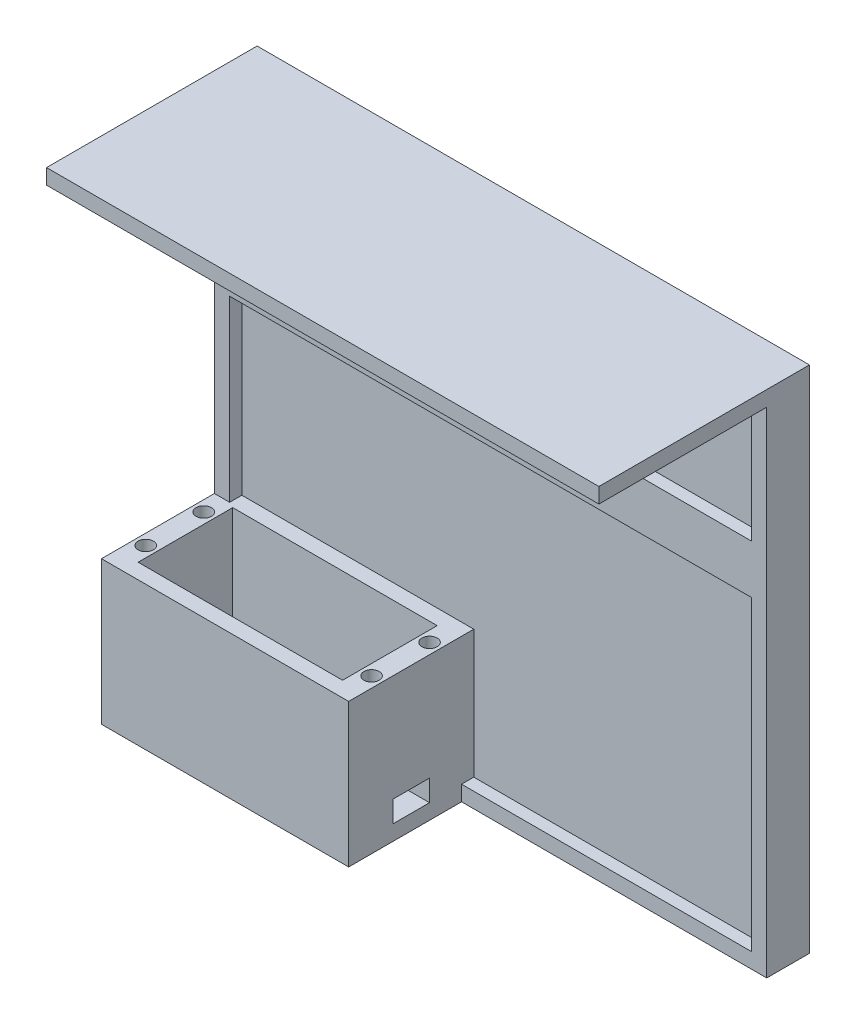
ISO-10303-21;
HEADER;
FILE_DESCRIPTION(('STEP AP214'),'2;1');
FILE_NAME('part.step','',(''),(''),'','','');
FILE_SCHEMA(('AUTOMOTIVE_DESIGN { 1 0 10303 214 1 1 1 1 }'));
ENDSEC;
DATA;
#1=APPLICATION_CONTEXT('core data for automotive mechanical design processes');
#2=APPLICATION_PROTOCOL_DEFINITION('international standard','automotive_design',2000,#1);
#3=PRODUCT_CONTEXT('',#1,'mechanical');
#4=PRODUCT('Part','Part','',(#3));
#5=PRODUCT_RELATED_PRODUCT_CATEGORY('part','',(#4));
#6=PRODUCT_DEFINITION_FORMATION('','',#4);
#7=PRODUCT_DEFINITION_CONTEXT('part definition',#1,'design');
#8=PRODUCT_DEFINITION('design','',#6,#7);
#9=PRODUCT_DEFINITION_SHAPE('','',#8);
#10=(LENGTH_UNIT() NAMED_UNIT(*) SI_UNIT(.MILLI.,.METRE.));
#11=(NAMED_UNIT(*) PLANE_ANGLE_UNIT() SI_UNIT($,.RADIAN.));
#12=(NAMED_UNIT(*) SI_UNIT($,.STERADIAN.) SOLID_ANGLE_UNIT());
#13=UNCERTAINTY_MEASURE_WITH_UNIT(LENGTH_MEASURE(1.E-05),#10,'distance_accuracy_value','');
#14=(GEOMETRIC_REPRESENTATION_CONTEXT(3) GLOBAL_UNCERTAINTY_ASSIGNED_CONTEXT((#13)) GLOBAL_UNIT_ASSIGNED_CONTEXT((#10,
#11,#12)) REPRESENTATION_CONTEXT('',''));
#15=CARTESIAN_POINT('',(0.,0.,0.));
#16=DIRECTION('',(0.,0.,1.));
#17=DIRECTION('',(1.,0.,0.));
#18=AXIS2_PLACEMENT_3D('',#15,#16,#17);
#19=CARTESIAN_POINT('',(0.,0.,-16.5));
#20=DIRECTION('',(0.,0.,-1.));
#21=DIRECTION('',(-1.,0.,0.));
#22=AXIS2_PLACEMENT_3D('',#19,#20,#21);
#23=PLANE('',#22);
#24=DIRECTION('',(1.,0.,0.));
#25=VECTOR('',#24,1.);
#26=CARTESIAN_POINT('',(-40.5,157.,-16.5));
#27=LINE('',#26,#25);
#28=CARTESIAN_POINT('',(-40.5,157.,-16.5));
#29=VERTEX_POINT('',#28);
#30=CARTESIAN_POINT('',(-35.5,157.,-16.5));
#31=VERTEX_POINT('',#30);
#32=EDGE_CURVE('E115',#29,#31,#27,.T.);
#33=ORIENTED_EDGE('',*,*,#32,.F.);
#34=DIRECTION('',(0.,-1.,0.));
#35=VECTOR('',#34,1.);
#36=CARTESIAN_POINT('',(-40.5,100.5,-16.5));
#37=LINE('',#36,#35);
#38=CARTESIAN_POINT('',(-40.5,42.,-16.5));
#39=VERTEX_POINT('',#38);
#40=EDGE_CURVE('E317',#29,#39,#37,.T.);
#41=ORIENTED_EDGE('',*,*,#40,.T.);
#42=DIRECTION('',(1.,0.,0.));
#43=VECTOR('',#42,1.);
#44=CARTESIAN_POINT('',(-40.5,42.,-16.5));
#45=LINE('',#44,#43);
#46=CARTESIAN_POINT('',(-35.5,42.,-16.5));
#47=VERTEX_POINT('',#46);
#48=EDGE_CURVE('E348',#39,#47,#45,.T.);
#49=ORIENTED_EDGE('',*,*,#48,.T.);
#50=DIRECTION('',(0.,1.,0.));
#51=VECTOR('',#50,1.);
#52=CARTESIAN_POINT('',(-35.5,42.,-16.5));
#53=LINE('',#52,#51);
#54=CARTESIAN_POINT('',(-35.5,100.5,-16.5));
#55=VERTEX_POINT('',#54);
#56=EDGE_CURVE('E353',#47,#55,#53,.T.);
#57=ORIENTED_EDGE('',*,*,#56,.T.);
#58=DIRECTION('',(1.,0.,0.));
#59=VECTOR('',#58,1.);
#60=CARTESIAN_POINT('',(-40.5,100.5,-16.5));
#61=LINE('',#60,#59);
#62=CARTESIAN_POINT('',(135.5,100.5,-16.5));
#63=VERTEX_POINT('',#62);
#64=EDGE_CURVE('E382',#55,#63,#61,.T.);
#65=ORIENTED_EDGE('',*,*,#64,.T.);
#66=DIRECTION('',(0.,1.,0.));
#67=VECTOR('',#66,1.);
#68=CARTESIAN_POINT('',(135.5,0.,-16.5));
#69=LINE('',#68,#67);
#70=CARTESIAN_POINT('',(135.5,0.,-16.5));
#71=VERTEX_POINT('',#70);
#72=EDGE_CURVE('E359',#71,#63,#69,.T.);
#73=ORIENTED_EDGE('',*,*,#72,.F.);
#74=DIRECTION('',(1.,0.,0.));
#75=VECTOR('',#74,1.);
#76=CARTESIAN_POINT('',(0.,0.,-16.5));
#77=LINE('',#76,#75);
#78=CARTESIAN_POINT('',(40.5,0.,-16.5));
#79=VERTEX_POINT('',#78);
#80=EDGE_CURVE('E363',#79,#71,#77,.T.);
#81=ORIENTED_EDGE('',*,*,#80,.F.);
#82=DIRECTION('',(0.,-1.,0.));
#83=VECTOR('',#82,1.);
#84=CARTESIAN_POINT('',(40.5,0.,-16.5));
#85=LINE('',#84,#83);
#86=CARTESIAN_POINT('',(40.5,-5.,-16.5));
#87=VERTEX_POINT('',#86);
#88=EDGE_CURVE('E366',#79,#87,#85,.T.);
#89=ORIENTED_EDGE('',*,*,#88,.T.);
#90=DIRECTION('',(1.,0.,0.));
#91=VECTOR('',#90,1.);
#92=CARTESIAN_POINT('',(0.,-5.,-16.5));
#93=LINE('',#92,#91);
#94=CARTESIAN_POINT('',(140.5,-5.,-16.5));
#95=VERTEX_POINT('',#94);
#96=EDGE_CURVE('E357',#87,#95,#93,.T.);
#97=ORIENTED_EDGE('',*,*,#96,.T.);
#98=DIRECTION('',(0.,1.,0.));
#99=VECTOR('',#98,1.);
#100=CARTESIAN_POINT('',(140.5,100.5,-16.5));
#101=LINE('',#100,#99);
#102=CARTESIAN_POINT('',(140.5,157.,-16.5));
#103=VERTEX_POINT('',#102);
#104=EDGE_CURVE('E108',#95,#103,#101,.T.);
#105=ORIENTED_EDGE('',*,*,#104,.T.);
#106=CARTESIAN_POINT('',(135.5,157.,-16.5));
#107=VERTEX_POINT('',#106);
#108=EDGE_CURVE('E1071',#107,#103,#27,.T.);
#109=ORIENTED_EDGE('',*,*,#108,.F.);
#110=DIRECTION('',(0.,-1.,0.));
#111=VECTOR('',#110,1.);
#112=CARTESIAN_POINT('',(135.5,162.,-16.5));
#113=LINE('',#112,#111);
#114=CARTESIAN_POINT('',(135.5,116.5,-16.5));
#115=VERTEX_POINT('',#114);
#116=EDGE_CURVE('E333',#107,#115,#113,.T.);
#117=ORIENTED_EDGE('',*,*,#116,.T.);
#118=DIRECTION('',(-1.,0.,0.));
#119=VECTOR('',#118,1.);
#120=CARTESIAN_POINT('',(-40.5,116.5,-16.5));
#121=LINE('',#120,#119);
#122=CARTESIAN_POINT('',(-35.5,116.5,-16.5));
#123=VERTEX_POINT('',#122);
#124=EDGE_CURVE('E386',#115,#123,#121,.T.);
#125=ORIENTED_EDGE('',*,*,#124,.T.);
#126=DIRECTION('',(0.,1.,0.));
#127=VECTOR('',#126,1.);
#128=CARTESIAN_POINT('',(-35.5,116.5,-16.5));
#129=LINE('',#128,#127);
#130=EDGE_CURVE('E341',#123,#31,#129,.T.);
#131=ORIENTED_EDGE('',*,*,#130,.T.);
#132=EDGE_LOOP('',(#33,#41,#49,#57,#65,#73,#81,#89,#97,#105,#109,#117,#125,#131));
#133=FACE_BOUND('',#132,.T.);
#134=ADVANCED_FACE('F91',(#133),#23,.F.);
#135=CARTESIAN_POINT('',(40.5,162.,-20.5));
#136=DIRECTION('',(0.,0.,-1.));
#137=DIRECTION('',(-1.,0.,0.));
#138=AXIS2_PLACEMENT_3D('',#135,#136,#137);
#139=PLANE('',#138);
#140=DIRECTION('',(0.,1.,0.));
#141=VECTOR('',#140,1.);
#142=CARTESIAN_POINT('',(-35.5,116.5,-20.5));
#143=LINE('',#142,#141);
#144=CARTESIAN_POINT('',(-35.5,116.5,-20.5));
#145=VERTEX_POINT('',#144);
#146=CARTESIAN_POINT('',(-35.5,157.,-20.5));
#147=VERTEX_POINT('',#146);
#148=EDGE_CURVE('E329',#145,#147,#143,.T.);
#149=ORIENTED_EDGE('',*,*,#148,.F.);
#150=DIRECTION('',(-1.,0.,0.));
#151=VECTOR('',#150,1.);
#152=CARTESIAN_POINT('',(-40.5,116.5,-20.5));
#153=LINE('',#152,#151);
#154=CARTESIAN_POINT('',(135.5,116.5,-20.5));
#155=VERTEX_POINT('',#154);
#156=EDGE_CURVE('E383',#155,#145,#153,.T.);
#157=ORIENTED_EDGE('',*,*,#156,.F.);
#158=DIRECTION('',(0.,-1.,0.));
#159=VECTOR('',#158,1.);
#160=CARTESIAN_POINT('',(135.5,162.,-20.5));
#161=LINE('',#160,#159);
#162=CARTESIAN_POINT('',(135.5,157.,-20.5));
#163=VERTEX_POINT('',#162);
#164=EDGE_CURVE('E334',#163,#155,#161,.T.);
#165=ORIENTED_EDGE('',*,*,#164,.F.);
#166=DIRECTION('',(1.,0.,0.));
#167=VECTOR('',#166,1.);
#168=CARTESIAN_POINT('',(-40.5,157.,-20.5));
#169=LINE('',#168,#167);
#170=EDGE_CURVE('E328',#147,#163,#169,.T.);
#171=ORIENTED_EDGE('',*,*,#170,.F.);
#172=EDGE_LOOP('',(#149,#157,#165,#171));
#173=FACE_BOUND('',#172,.T.);
#174=ADVANCED_FACE('F589',(#173),#139,.F.);
#175=CARTESIAN_POINT('',(-40.5,116.5,-16.5));
#176=DIRECTION('',(0.,-1.,0.));
#177=DIRECTION('',(0.,0.,-1.));
#178=AXIS2_PLACEMENT_3D('',#175,#176,#177);
#179=PLANE('',#178);
#180=DIRECTION('',(0.,0.,-1.));
#181=VECTOR('',#180,1.);
#182=CARTESIAN_POINT('',(-35.5,116.5,-16.5));
#183=LINE('',#182,#181);
#184=EDGE_CURVE('E320',#123,#145,#183,.T.);
#185=ORIENTED_EDGE('',*,*,#184,.F.);
#186=ORIENTED_EDGE('',*,*,#124,.F.);
#187=DIRECTION('',(0.,0.,-1.));
#188=VECTOR('',#187,1.);
#189=CARTESIAN_POINT('',(135.5,116.5,-16.5));
#190=LINE('',#189,#188);
#191=EDGE_CURVE('E330',#115,#155,#190,.T.);
#192=ORIENTED_EDGE('',*,*,#191,.T.);
#193=ORIENTED_EDGE('',*,*,#156,.T.);
#194=EDGE_LOOP('',(#185,#186,#192,#193));
#195=FACE_BOUND('',#194,.T.);
#196=ADVANCED_FACE('F594',(#195),#179,.F.);
#197=DIRECTION('',(0.,1.,0.));
#198=VECTOR('',#197,1.);
#199=CARTESIAN_POINT('',(-35.5,42.,-20.5));
#200=LINE('',#199,#198);
#201=CARTESIAN_POINT('',(-35.5,42.,-20.5));
#202=VERTEX_POINT('',#201);
#203=CARTESIAN_POINT('',(-35.5,100.5,-20.5));
#204=VERTEX_POINT('',#203);
#205=EDGE_CURVE('E350',#202,#204,#200,.T.);
#206=ORIENTED_EDGE('',*,*,#205,.F.);
#207=DIRECTION('',(1.,0.,0.));
#208=VECTOR('',#207,1.);
#209=CARTESIAN_POINT('',(40.5,42.,-20.5));
#210=LINE('',#209,#208);
#211=CARTESIAN_POINT('',(40.5,42.,-20.5));
#212=VERTEX_POINT('',#211);
#213=EDGE_CURVE('E399',#202,#212,#210,.T.);
#214=ORIENTED_EDGE('',*,*,#213,.T.);
#215=DIRECTION('',(0.,-1.,0.));
#216=VECTOR('',#215,1.);
#217=CARTESIAN_POINT('',(40.5,-5.,-20.5));
#218=LINE('',#217,#216);
#219=CARTESIAN_POINT('',(40.5,0.,-20.5));
#220=VERTEX_POINT('',#219);
#221=EDGE_CURVE('E12',#212,#220,#218,.T.);
#222=ORIENTED_EDGE('',*,*,#221,.T.);
#223=DIRECTION('',(1.,0.,0.));
#224=VECTOR('',#223,1.);
#225=CARTESIAN_POINT('',(0.,0.,-20.5));
#226=LINE('',#225,#224);
#227=CARTESIAN_POINT('',(135.5,0.,-20.5));
#228=VERTEX_POINT('',#227);
#229=EDGE_CURVE('E360',#220,#228,#226,.T.);
#230=ORIENTED_EDGE('',*,*,#229,.T.);
#231=DIRECTION('',(0.,1.,0.));
#232=VECTOR('',#231,1.);
#233=CARTESIAN_POINT('',(135.5,0.,-20.5));
#234=LINE('',#233,#232);
#235=CARTESIAN_POINT('',(135.5,100.5,-20.5));
#236=VERTEX_POINT('',#235);
#237=EDGE_CURVE('E352',#228,#236,#234,.T.);
#238=ORIENTED_EDGE('',*,*,#237,.T.);
#239=DIRECTION('',(1.,0.,0.));
#240=VECTOR('',#239,1.);
#241=CARTESIAN_POINT('',(-40.5,100.5,-20.5));
#242=LINE('',#241,#240);
#243=EDGE_CURVE('E380',#204,#236,#242,.T.);
#244=ORIENTED_EDGE('',*,*,#243,.F.);
#245=EDGE_LOOP('',(#206,#214,#222,#230,#238,#244));
#246=FACE_BOUND('',#245,.T.);
#247=ADVANCED_FACE('F562',(#246),#139,.F.);
#248=CARTESIAN_POINT('',(0.,42.,0.));
#249=DIRECTION('',(0.,-1.,0.));
#250=DIRECTION('',(0.,0.,-1.));
#251=AXIS2_PLACEMENT_3D('',#248,#249,#250);
#252=PLANE('',#251);
#253=CARTESIAN_POINT('',(37.,42.,-9.5));
#254=DIRECTION('',(0.,-1.,0.));
#255=DIRECTION('',(0.,0.,1.));
#256=AXIS2_PLACEMENT_3D('',#253,#254,#255);
#257=CIRCLE('',#256,2.5);
#258=CARTESIAN_POINT('',(37.,42.,-7.));
#259=VERTEX_POINT('',#258);
#260=EDGE_CURVE('E445',#259,#259,#257,.T.);
#261=ORIENTED_EDGE('',*,*,#260,.T.);
#262=EDGE_LOOP('',(#261));
#263=FACE_BOUND('',#262,.T.);
#264=CARTESIAN_POINT('',(37.,42.,9.5));
#265=DIRECTION('',(0.,-1.,0.));
#266=DIRECTION('',(0.,0.,1.));
#267=AXIS2_PLACEMENT_3D('',#264,#265,#266);
#268=CIRCLE('',#267,2.5);
#269=CARTESIAN_POINT('',(37.,42.,12.));
#270=VERTEX_POINT('',#269);
#271=EDGE_CURVE('E440',#270,#270,#268,.T.);
#272=ORIENTED_EDGE('',*,*,#271,.T.);
#273=EDGE_LOOP('',(#272));
#274=FACE_BOUND('',#273,.T.);
#275=CARTESIAN_POINT('',(-37.,42.,-9.5));
#276=DIRECTION('',(0.,1.,0.));
#277=DIRECTION('',(0.,0.,1.));
#278=AXIS2_PLACEMENT_3D('',#275,#276,#277);
#279=CIRCLE('',#278,2.5);
#280=CARTESIAN_POINT('',(-37.,42.,-7.));
#281=VERTEX_POINT('',#280);
#282=EDGE_CURVE('E486',#281,#281,#279,.T.);
#283=ORIENTED_EDGE('',*,*,#282,.F.);
#284=EDGE_LOOP('',(#283));
#285=FACE_BOUND('',#284,.T.);
#286=CARTESIAN_POINT('',(-37.,42.,9.5));
#287=DIRECTION('',(0.,1.,0.));
#288=DIRECTION('',(0.,0.,1.));
#289=AXIS2_PLACEMENT_3D('',#286,#287,#288);
#290=CIRCLE('',#289,2.5);
#291=CARTESIAN_POINT('',(-37.,42.,12.));
#292=VERTEX_POINT('',#291);
#293=EDGE_CURVE('E489',#292,#292,#290,.T.);
#294=ORIENTED_EDGE('',*,*,#293,.F.);
#295=EDGE_LOOP('',(#294));
#296=FACE_BOUND('',#295,.T.);
#297=DIRECTION('',(0.,0.,-1.));
#298=VECTOR('',#297,1.);
#299=CARTESIAN_POINT('',(33.5,42.,15.5));
#300=LINE('',#299,#298);
#301=CARTESIAN_POINT('',(33.5,42.,15.5));
#302=VERTEX_POINT('',#301);
#303=CARTESIAN_POINT('',(33.5,42.,-15.5));
#304=VERTEX_POINT('',#303);
#305=EDGE_CURVE('E497',#302,#304,#300,.T.);
#306=ORIENTED_EDGE('',*,*,#305,.F.);
#307=DIRECTION('',(1.,0.,0.));
#308=VECTOR('',#307,1.);
#309=CARTESIAN_POINT('',(-33.5,42.,15.5));
#310=LINE('',#309,#308);
#311=CARTESIAN_POINT('',(-33.5,42.,15.5));
#312=VERTEX_POINT('',#311);
#313=EDGE_CURVE('E516',#312,#302,#310,.T.);
#314=ORIENTED_EDGE('',*,*,#313,.F.);
#315=DIRECTION('',(0.,0.,1.));
#316=VECTOR('',#315,1.);
#317=CARTESIAN_POINT('',(-33.5,42.,15.5));
#318=LINE('',#317,#316);
#319=CARTESIAN_POINT('',(-33.5,42.,-15.5));
#320=VERTEX_POINT('',#319);
#321=EDGE_CURVE('E513',#320,#312,#318,.T.);
#322=ORIENTED_EDGE('',*,*,#321,.F.);
#323=DIRECTION('',(-1.,0.,0.));
#324=VECTOR('',#323,1.);
#325=CARTESIAN_POINT('',(-33.5,42.,-15.5));
#326=LINE('',#325,#324);
#327=EDGE_CURVE('E510',#304,#320,#326,.T.);
#328=ORIENTED_EDGE('',*,*,#327,.F.);
#329=EDGE_LOOP('',(#306,#314,#322,#328));
#330=FACE_BOUND('',#329,.T.);
#331=DIRECTION('',(0.,0.,-1.));
#332=VECTOR('',#331,1.);
#333=CARTESIAN_POINT('',(-35.5,42.,-16.5));
#334=LINE('',#333,#332);
#335=EDGE_CURVE('E336',#47,#202,#334,.T.);
#336=ORIENTED_EDGE('',*,*,#335,.F.);
#337=ORIENTED_EDGE('',*,*,#48,.F.);
#338=DIRECTION('',(0.,0.,1.));
#339=VECTOR('',#338,1.);
#340=CARTESIAN_POINT('',(-40.5,42.,20.5));
#341=LINE('',#340,#339);
#342=CARTESIAN_POINT('',(-40.5,42.,20.5));
#343=VERTEX_POINT('',#342);
#344=EDGE_CURVE('E522',#39,#343,#341,.T.);
#345=ORIENTED_EDGE('',*,*,#344,.T.);
#346=DIRECTION('',(1.,0.,0.));
#347=VECTOR('',#346,1.);
#348=CARTESIAN_POINT('',(-40.5,42.,20.5));
#349=LINE('',#348,#347);
#350=CARTESIAN_POINT('',(40.5,42.,20.5));
#351=VERTEX_POINT('',#350);
#352=EDGE_CURVE('E524',#343,#351,#349,.T.);
#353=ORIENTED_EDGE('',*,*,#352,.T.);
#354=DIRECTION('',(0.,0.,-1.));
#355=VECTOR('',#354,1.);
#356=CARTESIAN_POINT('',(40.5,42.,20.5));
#357=LINE('',#356,#355);
#358=EDGE_CURVE('E519',#351,#212,#357,.T.);
#359=ORIENTED_EDGE('',*,*,#358,.T.);
#360=ORIENTED_EDGE('',*,*,#213,.F.);
#361=EDGE_LOOP('',(#336,#337,#345,#353,#359,#360));
#362=FACE_BOUND('',#361,.T.);
#363=ADVANCED_FACE('F552',(#263,#274,#285,#296,#330,#362),#252,.F.);
#364=CARTESIAN_POINT('',(-40.5,100.5,-16.5));
#365=DIRECTION('',(0.,1.,0.));
#366=DIRECTION('',(0.,0.,1.));
#367=AXIS2_PLACEMENT_3D('',#364,#365,#366);
#368=PLANE('',#367);
#369=DIRECTION('',(0.,0.,-1.));
#370=VECTOR('',#369,1.);
#371=CARTESIAN_POINT('',(-35.5,100.5,-16.5));
#372=LINE('',#371,#370);
#373=EDGE_CURVE('E345',#55,#204,#372,.T.);
#374=ORIENTED_EDGE('',*,*,#373,.T.);
#375=ORIENTED_EDGE('',*,*,#243,.T.);
#376=DIRECTION('',(0.,0.,-1.));
#377=VECTOR('',#376,1.);
#378=CARTESIAN_POINT('',(135.5,100.5,-16.5));
#379=LINE('',#378,#377);
#380=EDGE_CURVE('E377',#63,#236,#379,.T.);
#381=ORIENTED_EDGE('',*,*,#380,.F.);
#382=ORIENTED_EDGE('',*,*,#64,.F.);
#383=EDGE_LOOP('',(#374,#375,#381,#382));
#384=FACE_BOUND('',#383,.T.);
#385=ADVANCED_FACE('F571',(#384),#368,.F.);
#386=CARTESIAN_POINT('',(33.5,-5.,15.5));
#387=DIRECTION('',(1.,0.,0.));
#388=DIRECTION('',(0.,0.,-1.));
#389=AXIS2_PLACEMENT_3D('',#386,#387,#388);
#390=PLANE('',#389);
#391=DIRECTION('',(0.,-1.,0.));
#392=VECTOR('',#391,1.);
#393=CARTESIAN_POINT('',(33.5,-5.,-6.));
#394=LINE('',#393,#392);
#395=CARTESIAN_POINT('',(33.5,7.,-6.));
#396=VERTEX_POINT('',#395);
#397=CARTESIAN_POINT('',(33.5,0.,-6.));
#398=VERTEX_POINT('',#397);
#399=EDGE_CURVE('E436',#396,#398,#394,.T.);
#400=ORIENTED_EDGE('',*,*,#399,.F.);
#401=DIRECTION('',(0.,0.,-1.));
#402=VECTOR('',#401,1.);
#403=CARTESIAN_POINT('',(33.5,7.,15.5));
#404=LINE('',#403,#402);
#405=CARTESIAN_POINT('',(33.5,7.,6.));
#406=VERTEX_POINT('',#405);
#407=EDGE_CURVE('E438',#406,#396,#404,.T.);
#408=ORIENTED_EDGE('',*,*,#407,.F.);
#409=DIRECTION('',(0.,1.,0.));
#410=VECTOR('',#409,1.);
#411=CARTESIAN_POINT('',(33.5,-5.,6.));
#412=LINE('',#411,#410);
#413=CARTESIAN_POINT('',(33.5,0.,6.));
#414=VERTEX_POINT('',#413);
#415=EDGE_CURVE('E427',#414,#406,#412,.T.);
#416=ORIENTED_EDGE('',*,*,#415,.F.);
#417=DIRECTION('',(0.,0.,1.));
#418=VECTOR('',#417,1.);
#419=CARTESIAN_POINT('',(33.5,0.,15.5));
#420=LINE('',#419,#418);
#421=CARTESIAN_POINT('',(33.5,0.,15.5));
#422=VERTEX_POINT('',#421);
#423=EDGE_CURVE('E485',#414,#422,#420,.T.);
#424=ORIENTED_EDGE('',*,*,#423,.T.);
#425=DIRECTION('',(0.,1.,0.));
#426=VECTOR('',#425,1.);
#427=CARTESIAN_POINT('',(33.5,-5.,15.5));
#428=LINE('',#427,#426);
#429=EDGE_CURVE('E528',#422,#302,#428,.T.);
#430=ORIENTED_EDGE('',*,*,#429,.T.);
#431=ORIENTED_EDGE('',*,*,#305,.T.);
#432=DIRECTION('',(0.,1.,0.));
#433=VECTOR('',#432,1.);
#434=CARTESIAN_POINT('',(33.5,-5.,-15.5));
#435=LINE('',#434,#433);
#436=CARTESIAN_POINT('',(33.5,0.,-15.5));
#437=VERTEX_POINT('',#436);
#438=EDGE_CURVE('E527',#437,#304,#435,.T.);
#439=ORIENTED_EDGE('',*,*,#438,.F.);
#440=EDGE_CURVE('E503',#437,#398,#420,.T.);
#441=ORIENTED_EDGE('',*,*,#440,.T.);
#442=EDGE_LOOP('',(#400,#408,#416,#424,#430,#431,#439,#441));
#443=FACE_BOUND('',#442,.T.);
#444=ADVANCED_FACE('F603',(#443),#390,.F.);
#445=CARTESIAN_POINT('',(40.5,-5.,20.5));
#446=DIRECTION('',(1.,0.,0.));
#447=DIRECTION('',(0.,0.,-1.));
#448=AXIS2_PLACEMENT_3D('',#445,#446,#447);
#449=PLANE('',#448);
#450=DIRECTION('',(0.,0.,-1.));
#451=VECTOR('',#450,1.);
#452=CARTESIAN_POINT('',(40.5,0.,-16.5));
#453=LINE('',#452,#451);
#454=EDGE_CURVE('E368',#79,#220,#453,.T.);
#455=ORIENTED_EDGE('',*,*,#454,.T.);
#456=ORIENTED_EDGE('',*,*,#221,.F.);
#457=ORIENTED_EDGE('',*,*,#358,.F.);
#458=DIRECTION('',(0.,1.,0.));
#459=VECTOR('',#458,1.);
#460=CARTESIAN_POINT('',(40.5,-5.,20.5));
#461=LINE('',#460,#459);
#462=CARTESIAN_POINT('',(40.5,-5.,20.5));
#463=VERTEX_POINT('',#462);
#464=EDGE_CURVE('E100',#463,#351,#461,.T.);
#465=ORIENTED_EDGE('',*,*,#464,.F.);
#466=DIRECTION('',(0.,0.,-1.));
#467=VECTOR('',#466,1.);
#468=CARTESIAN_POINT('',(40.5,-5.,20.5));
#469=LINE('',#468,#467);
#470=EDGE_CURVE('E530',#463,#87,#469,.T.);
#471=ORIENTED_EDGE('',*,*,#470,.T.);
#472=ORIENTED_EDGE('',*,*,#88,.F.);
#473=EDGE_LOOP('',(#455,#456,#457,#465,#471,#472));
#474=FACE_BOUND('',#473,.T.);
#475=DIRECTION('',(0.,0.,-1.));
#476=VECTOR('',#475,1.);
#477=CARTESIAN_POINT('',(40.5,7.,-6.));
#478=LINE('',#477,#476);
#479=CARTESIAN_POINT('',(40.5,7.,6.));
#480=VERTEX_POINT('',#479);
#481=CARTESIAN_POINT('',(40.5,7.,-6.));
#482=VERTEX_POINT('',#481);
#483=EDGE_CURVE('E415',#480,#482,#478,.T.);
#484=ORIENTED_EDGE('',*,*,#483,.T.);
#485=DIRECTION('',(0.,-1.,0.));
#486=VECTOR('',#485,1.);
#487=CARTESIAN_POINT('',(40.5,0.,-6.));
#488=LINE('',#487,#486);
#489=CARTESIAN_POINT('',(40.5,0.,-6.));
#490=VERTEX_POINT('',#489);
#491=EDGE_CURVE('E412',#482,#490,#488,.T.);
#492=ORIENTED_EDGE('',*,*,#491,.T.);
#493=DIRECTION('',(0.,0.,1.));
#494=VECTOR('',#493,1.);
#495=CARTESIAN_POINT('',(40.5,0.,-6.));
#496=LINE('',#495,#494);
#497=CARTESIAN_POINT('',(40.5,0.,6.));
#498=VERTEX_POINT('',#497);
#499=EDGE_CURVE('E421',#490,#498,#496,.T.);
#500=ORIENTED_EDGE('',*,*,#499,.T.);
#501=DIRECTION('',(0.,1.,0.));
#502=VECTOR('',#501,1.);
#503=CARTESIAN_POINT('',(40.5,0.,6.));
#504=LINE('',#503,#502);
#505=EDGE_CURVE('E418',#498,#480,#504,.T.);
#506=ORIENTED_EDGE('',*,*,#505,.T.);
#507=EDGE_LOOP('',(#484,#492,#500,#506));
#508=FACE_BOUND('',#507,.T.);
#509=ADVANCED_FACE('F93',(#474,#508),#449,.T.);
#510=CARTESIAN_POINT('',(-33.5,-5.,15.5));
#511=DIRECTION('',(0.,0.,1.));
#512=DIRECTION('',(1.,0.,0.));
#513=AXIS2_PLACEMENT_3D('',#510,#511,#512);
#514=PLANE('',#513);
#515=DIRECTION('',(-1.,0.,0.));
#516=VECTOR('',#515,1.);
#517=CARTESIAN_POINT('',(40.502,0.,15.5));
#518=LINE('',#517,#516);
#519=CARTESIAN_POINT('',(-33.5,0.,15.5));
#520=VERTEX_POINT('',#519);
#521=EDGE_CURVE('E502',#422,#520,#518,.T.);
#522=ORIENTED_EDGE('',*,*,#521,.T.);
#523=DIRECTION('',(0.,1.,0.));
#524=VECTOR('',#523,1.);
#525=CARTESIAN_POINT('',(-33.5,-5.,15.5));
#526=LINE('',#525,#524);
#527=EDGE_CURVE('E531',#520,#312,#526,.T.);
#528=ORIENTED_EDGE('',*,*,#527,.T.);
#529=ORIENTED_EDGE('',*,*,#313,.T.);
#530=ORIENTED_EDGE('',*,*,#429,.F.);
#531=EDGE_LOOP('',(#522,#528,#529,#530));
#532=FACE_BOUND('',#531,.T.);
#533=ADVANCED_FACE('F664',(#532),#514,.F.);
#534=CARTESIAN_POINT('',(-33.5,-5.,15.5));
#535=DIRECTION('',(-1.,0.,0.));
#536=DIRECTION('',(0.,0.,1.));
#537=AXIS2_PLACEMENT_3D('',#534,#535,#536);
#538=PLANE('',#537);
#539=DIRECTION('',(0.,0.,-1.));
#540=VECTOR('',#539,1.);
#541=CARTESIAN_POINT('',(-33.5,7.,15.5));
#542=LINE('',#541,#540);
#543=CARTESIAN_POINT('',(-33.5,7.,6.));
#544=VERTEX_POINT('',#543);
#545=CARTESIAN_POINT('',(-33.5,7.,-6.));
#546=VERTEX_POINT('',#545);
#547=EDGE_CURVE('E478',#544,#546,#542,.T.);
#548=ORIENTED_EDGE('',*,*,#547,.T.);
#549=DIRECTION('',(0.,-1.,0.));
#550=VECTOR('',#549,1.);
#551=CARTESIAN_POINT('',(-33.5,-5.,-6.));
#552=LINE('',#551,#550);
#553=CARTESIAN_POINT('',(-33.5,0.,-6.));
#554=VERTEX_POINT('',#553);
#555=EDGE_CURVE('E475',#546,#554,#552,.T.);
#556=ORIENTED_EDGE('',*,*,#555,.T.);
#557=DIRECTION('',(0.,0.,1.));
#558=VECTOR('',#557,1.);
#559=CARTESIAN_POINT('',(-33.5,0.,15.5));
#560=LINE('',#559,#558);
#561=CARTESIAN_POINT('',(-33.5,0.,-15.5));
#562=VERTEX_POINT('',#561);
#563=EDGE_CURVE('E494',#562,#554,#560,.T.);
#564=ORIENTED_EDGE('',*,*,#563,.F.);
#565=DIRECTION('',(0.,1.,0.));
#566=VECTOR('',#565,1.);
#567=CARTESIAN_POINT('',(-33.5,-5.,-15.5));
#568=LINE('',#567,#566);
#569=EDGE_CURVE('E533',#562,#320,#568,.T.);
#570=ORIENTED_EDGE('',*,*,#569,.T.);
#571=ORIENTED_EDGE('',*,*,#321,.T.);
#572=ORIENTED_EDGE('',*,*,#527,.F.);
#573=CARTESIAN_POINT('',(-33.5,0.,6.));
#574=VERTEX_POINT('',#573);
#575=EDGE_CURVE('E498',#574,#520,#560,.T.);
#576=ORIENTED_EDGE('',*,*,#575,.F.);
#577=DIRECTION('',(0.,1.,0.));
#578=VECTOR('',#577,1.);
#579=CARTESIAN_POINT('',(-33.5,-5.,6.));
#580=LINE('',#579,#578);
#581=EDGE_CURVE('E466',#574,#544,#580,.T.);
#582=ORIENTED_EDGE('',*,*,#581,.T.);
#583=EDGE_LOOP('',(#548,#556,#564,#570,#571,#572,#576,#582));
#584=FACE_BOUND('',#583,.T.);
#585=ADVANCED_FACE('F667',(#584),#538,.F.);
#586=CARTESIAN_POINT('',(-33.5,-5.,-15.5));
#587=DIRECTION('',(0.,0.,-1.));
#588=DIRECTION('',(-1.,0.,0.));
#589=AXIS2_PLACEMENT_3D('',#586,#587,#588);
#590=PLANE('',#589);
#591=DIRECTION('',(-1.,0.,0.));
#592=VECTOR('',#591,1.);
#593=CARTESIAN_POINT('',(40.502,0.,-15.5));
#594=LINE('',#593,#592);
#595=EDGE_CURVE('E499',#437,#562,#594,.T.);
#596=ORIENTED_EDGE('',*,*,#595,.F.);
#597=ORIENTED_EDGE('',*,*,#438,.T.);
#598=ORIENTED_EDGE('',*,*,#327,.T.);
#599=ORIENTED_EDGE('',*,*,#569,.F.);
#600=EDGE_LOOP('',(#596,#597,#598,#599));
#601=FACE_BOUND('',#600,.T.);
#602=ADVANCED_FACE('F671',(#601),#590,.F.);
#603=CARTESIAN_POINT('',(-40.5,-5.,20.5));
#604=DIRECTION('',(0.,0.,1.));
#605=DIRECTION('',(1.,0.,0.));
#606=AXIS2_PLACEMENT_3D('',#603,#604,#605);
#607=PLANE('',#606);
#608=ORIENTED_EDGE('',*,*,#464,.T.);
#609=ORIENTED_EDGE('',*,*,#352,.F.);
#610=DIRECTION('',(0.,1.,0.));
#611=VECTOR('',#610,1.);
#612=CARTESIAN_POINT('',(-40.5,-5.,20.5));
#613=LINE('',#612,#611);
#614=CARTESIAN_POINT('',(-40.5,-5.,20.5));
#615=VERTEX_POINT('',#614);
#616=EDGE_CURVE('E95',#615,#343,#613,.T.);
#617=ORIENTED_EDGE('',*,*,#616,.F.);
#618=DIRECTION('',(1.,0.,0.));
#619=VECTOR('',#618,1.);
#620=CARTESIAN_POINT('',(-40.5,-5.,20.5));
#621=LINE('',#620,#619);
#622=EDGE_CURVE('E541',#615,#463,#621,.T.);
#623=ORIENTED_EDGE('',*,*,#622,.T.);
#624=EDGE_LOOP('',(#608,#609,#617,#623));
#625=FACE_BOUND('',#624,.T.);
#626=ADVANCED_FACE('F548',(#625),#607,.T.);
#627=CARTESIAN_POINT('',(-40.5,-5.,20.5));
#628=DIRECTION('',(-1.,0.,0.));
#629=DIRECTION('',(0.,0.,1.));
#630=AXIS2_PLACEMENT_3D('',#627,#628,#629);
#631=PLANE('',#630);
#632=ORIENTED_EDGE('',*,*,#344,.F.);
#633=ORIENTED_EDGE('',*,*,#40,.F.);
#634=DIRECTION('',(0.,0.,-1.));
#635=VECTOR('',#634,1.);
#636=CARTESIAN_POINT('',(-40.5,157.,38.5));
#637=LINE('',#636,#635);
#638=CARTESIAN_POINT('',(-40.5,157.,38.5));
#639=VERTEX_POINT('',#638);
#640=EDGE_CURVE('E297',#639,#29,#637,.T.);
#641=ORIENTED_EDGE('',*,*,#640,.F.);
#642=DIRECTION('',(0.,-1.,0.));
#643=VECTOR('',#642,1.);
#644=CARTESIAN_POINT('',(-40.5,162.,38.5));
#645=LINE('',#644,#643);
#646=CARTESIAN_POINT('',(-40.5,162.,38.5));
#647=VERTEX_POINT('',#646);
#648=EDGE_CURVE('E304',#647,#639,#645,.T.);
#649=ORIENTED_EDGE('',*,*,#648,.F.);
#650=DIRECTION('',(0.,0.,1.));
#651=VECTOR('',#650,1.);
#652=CARTESIAN_POINT('',(-40.5,162.,-30.5));
#653=LINE('',#652,#651);
#654=CARTESIAN_POINT('',(-40.5,162.,-30.5));
#655=VERTEX_POINT('',#654);
#656=EDGE_CURVE('E404',#655,#647,#653,.T.);
#657=ORIENTED_EDGE('',*,*,#656,.F.);
#658=DIRECTION('',(0.,1.,0.));
#659=VECTOR('',#658,1.);
#660=CARTESIAN_POINT('',(-40.5,42.,-30.5));
#661=LINE('',#660,#659);
#662=CARTESIAN_POINT('',(-40.5,-5.,-30.5));
#663=VERTEX_POINT('',#662);
#664=EDGE_CURVE('E410',#663,#655,#661,.T.);
#665=ORIENTED_EDGE('',*,*,#664,.F.);
#666=DIRECTION('',(0.,0.,1.));
#667=VECTOR('',#666,1.);
#668=CARTESIAN_POINT('',(-40.5,-5.,20.5));
#669=LINE('',#668,#667);
#670=EDGE_CURVE('E538',#663,#615,#669,.T.);
#671=ORIENTED_EDGE('',*,*,#670,.T.);
#672=ORIENTED_EDGE('',*,*,#616,.T.);
#673=EDGE_LOOP('',(#632,#633,#641,#649,#657,#665,#671,#672));
#674=FACE_BOUND('',#673,.T.);
#675=DIRECTION('',(0.,-1.,0.));
#676=VECTOR('',#675,1.);
#677=CARTESIAN_POINT('',(-40.5,0.,-6.));
#678=LINE('',#677,#676);
#679=CARTESIAN_POINT('',(-40.5,7.,-6.));
#680=VERTEX_POINT('',#679);
#681=CARTESIAN_POINT('',(-40.5,0.,-6.));
#682=VERTEX_POINT('',#681);
#683=EDGE_CURVE('E444',#680,#682,#678,.T.);
#684=ORIENTED_EDGE('',*,*,#683,.F.);
#685=DIRECTION('',(0.,0.,-1.));
#686=VECTOR('',#685,1.);
#687=CARTESIAN_POINT('',(-40.5,7.,-6.));
#688=LINE('',#687,#686);
#689=CARTESIAN_POINT('',(-40.5,7.,6.));
#690=VERTEX_POINT('',#689);
#691=EDGE_CURVE('E460',#690,#680,#688,.T.);
#692=ORIENTED_EDGE('',*,*,#691,.F.);
#693=DIRECTION('',(0.,1.,0.));
#694=VECTOR('',#693,1.);
#695=CARTESIAN_POINT('',(-40.5,0.,6.));
#696=LINE('',#695,#694);
#697=CARTESIAN_POINT('',(-40.5,0.,6.));
#698=VERTEX_POINT('',#697);
#699=EDGE_CURVE('E457',#698,#690,#696,.T.);
#700=ORIENTED_EDGE('',*,*,#699,.F.);
#701=DIRECTION('',(0.,0.,1.));
#702=VECTOR('',#701,1.);
#703=CARTESIAN_POINT('',(-40.5,0.,-6.));
#704=LINE('',#703,#702);
#705=EDGE_CURVE('E454',#682,#698,#704,.T.);
#706=ORIENTED_EDGE('',*,*,#705,.F.);
#707=EDGE_LOOP('',(#684,#692,#700,#706));
#708=FACE_BOUND('',#707,.T.);
#709=ADVANCED_FACE('F315',(#674,#708),#631,.T.);
#710=CARTESIAN_POINT('',(0.,-5.,0.));
#711=DIRECTION('',(0.,-1.,0.));
#712=DIRECTION('',(0.,0.,-1.));
#713=AXIS2_PLACEMENT_3D('',#710,#711,#712);
#714=PLANE('',#713);
#715=CARTESIAN_POINT('',(37.,-5.,-9.5));
#716=DIRECTION('',(0.,-1.,0.));
#717=DIRECTION('',(0.,0.,1.));
#718=AXIS2_PLACEMENT_3D('',#715,#716,#717);
#719=CIRCLE('',#718,2.5);
#720=CARTESIAN_POINT('',(37.,-5.,-7.));
#721=VERTEX_POINT('',#720);
#722=EDGE_CURVE('E441',#721,#721,#719,.T.);
#723=ORIENTED_EDGE('',*,*,#722,.F.);
#724=EDGE_LOOP('',(#723));
#725=FACE_BOUND('',#724,.T.);
#726=CARTESIAN_POINT('',(37.,-5.,9.5));
#727=DIRECTION('',(0.,-1.,0.));
#728=DIRECTION('',(0.,0.,1.));
#729=AXIS2_PLACEMENT_3D('',#726,#727,#728);
#730=CIRCLE('',#729,2.5);
#731=CARTESIAN_POINT('',(37.,-5.,12.));
#732=VERTEX_POINT('',#731);
#733=EDGE_CURVE('E448',#732,#732,#730,.T.);
#734=ORIENTED_EDGE('',*,*,#733,.F.);
#735=EDGE_LOOP('',(#734));
#736=FACE_BOUND('',#735,.T.);
#737=CARTESIAN_POINT('',(-37.,-5.,-9.5));
#738=DIRECTION('',(0.,1.,0.));
#739=DIRECTION('',(0.,0.,1.));
#740=AXIS2_PLACEMENT_3D('',#737,#738,#739);
#741=CIRCLE('',#740,2.5);
#742=CARTESIAN_POINT('',(-37.,-5.,-7.));
#743=VERTEX_POINT('',#742);
#744=EDGE_CURVE('E482',#743,#743,#741,.T.);
#745=ORIENTED_EDGE('',*,*,#744,.T.);
#746=EDGE_LOOP('',(#745));
#747=FACE_BOUND('',#746,.T.);
#748=CARTESIAN_POINT('',(-37.,-5.,9.5));
#749=DIRECTION('',(0.,1.,0.));
#750=DIRECTION('',(0.,0.,1.));
#751=AXIS2_PLACEMENT_3D('',#748,#749,#750);
#752=CIRCLE('',#751,2.5);
#753=CARTESIAN_POINT('',(-37.,-5.,12.));
#754=VERTEX_POINT('',#753);
#755=EDGE_CURVE('E481',#754,#754,#752,.T.);
#756=ORIENTED_EDGE('',*,*,#755,.T.);
#757=EDGE_LOOP('',(#756));
#758=FACE_BOUND('',#757,.T.);
#759=ORIENTED_EDGE('',*,*,#470,.F.);
#760=ORIENTED_EDGE('',*,*,#622,.F.);
#761=ORIENTED_EDGE('',*,*,#670,.F.);
#762=DIRECTION('',(-1.,0.,0.));
#763=VECTOR('',#762,1.);
#764=CARTESIAN_POINT('',(40.5,-5.,-30.5));
#765=LINE('',#764,#763);
#766=CARTESIAN_POINT('',(140.5,-5.,-30.5));
#767=VERTEX_POINT('',#766);
#768=EDGE_CURVE('E406',#767,#663,#765,.T.);
#769=ORIENTED_EDGE('',*,*,#768,.F.);
#770=DIRECTION('',(0.,0.,-1.));
#771=VECTOR('',#770,1.);
#772=CARTESIAN_POINT('',(140.5,-5.,-30.5));
#773=LINE('',#772,#771);
#774=EDGE_CURVE('E397',#95,#767,#773,.T.);
#775=ORIENTED_EDGE('',*,*,#774,.F.);
#776=ORIENTED_EDGE('',*,*,#96,.F.);
#777=EDGE_LOOP('',(#759,#760,#761,#769,#775,#776));
#778=FACE_BOUND('',#777,.T.);
#779=ADVANCED_FACE('F659',(#725,#736,#747,#758,#778),#714,.T.);
#780=CARTESIAN_POINT('',(40.502,0.,15.5));
#781=DIRECTION('',(0.,-1.,0.));
#782=DIRECTION('',(0.,0.,-1.));
#783=AXIS2_PLACEMENT_3D('',#780,#781,#782);
#784=PLANE('',#783);
#785=ORIENTED_EDGE('',*,*,#423,.F.);
#786=DIRECTION('',(1.,0.,0.));
#787=VECTOR('',#786,1.);
#788=CARTESIAN_POINT('',(20.5,0.,6.));
#789=LINE('',#788,#787);
#790=EDGE_CURVE('E428',#414,#498,#789,.T.);
#791=ORIENTED_EDGE('',*,*,#790,.T.);
#792=ORIENTED_EDGE('',*,*,#499,.F.);
#793=DIRECTION('',(1.,0.,0.));
#794=VECTOR('',#793,1.);
#795=CARTESIAN_POINT('',(20.5,0.,-6.));
#796=LINE('',#795,#794);
#797=EDGE_CURVE('E425',#398,#490,#796,.T.);
#798=ORIENTED_EDGE('',*,*,#797,.F.);
#799=ORIENTED_EDGE('',*,*,#440,.F.);
#800=ORIENTED_EDGE('',*,*,#595,.T.);
#801=ORIENTED_EDGE('',*,*,#563,.T.);
#802=DIRECTION('',(-1.,0.,0.));
#803=VECTOR('',#802,1.);
#804=CARTESIAN_POINT('',(-20.5,0.,-6.));
#805=LINE('',#804,#803);
#806=EDGE_CURVE('E463',#554,#682,#805,.T.);
#807=ORIENTED_EDGE('',*,*,#806,.T.);
#808=ORIENTED_EDGE('',*,*,#705,.T.);
#809=DIRECTION('',(-1.,0.,0.));
#810=VECTOR('',#809,1.);
#811=CARTESIAN_POINT('',(-20.5,0.,6.));
#812=LINE('',#811,#810);
#813=EDGE_CURVE('E469',#574,#698,#812,.T.);
#814=ORIENTED_EDGE('',*,*,#813,.F.);
#815=ORIENTED_EDGE('',*,*,#575,.T.);
#816=ORIENTED_EDGE('',*,*,#521,.F.);
#817=EDGE_LOOP('',(#785,#791,#792,#798,#799,#800,#801,#807,#808,#814,#815,#816));
#818=FACE_BOUND('',#817,.T.);
#819=ADVANCED_FACE('F655',(#818),#784,.F.);
#820=CARTESIAN_POINT('',(-37.,-5.,9.5));
#821=DIRECTION('',(0.,1.,0.));
#822=DIRECTION('',(0.,0.,1.));
#823=AXIS2_PLACEMENT_3D('',#820,#821,#822);
#824=CYLINDRICAL_SURFACE('',#823,2.5);
#825=ORIENTED_EDGE('',*,*,#755,.F.);
#826=EDGE_LOOP('',(#825));
#827=FACE_BOUND('',#826,.T.);
#828=ORIENTED_EDGE('',*,*,#293,.T.);
#829=EDGE_LOOP('',(#828));
#830=FACE_BOUND('',#829,.T.);
#831=ADVANCED_FACE('F651',(#827,#830),#824,.F.);
#832=CARTESIAN_POINT('',(-37.,-5.,-9.5));
#833=DIRECTION('',(0.,1.,0.));
#834=DIRECTION('',(0.,0.,1.));
#835=AXIS2_PLACEMENT_3D('',#832,#833,#834);
#836=CYLINDRICAL_SURFACE('',#835,2.5);
#837=ORIENTED_EDGE('',*,*,#744,.F.);
#838=EDGE_LOOP('',(#837));
#839=FACE_BOUND('',#838,.T.);
#840=ORIENTED_EDGE('',*,*,#282,.T.);
#841=EDGE_LOOP('',(#840));
#842=FACE_BOUND('',#841,.T.);
#843=ADVANCED_FACE('F641',(#839,#842),#836,.F.);
#844=CARTESIAN_POINT('',(-20.5,7.,-6.));
#845=DIRECTION('',(0.,1.,0.));
#846=DIRECTION('',(0.,0.,1.));
#847=AXIS2_PLACEMENT_3D('',#844,#845,#846);
#848=PLANE('',#847);
#849=DIRECTION('',(-1.,0.,0.));
#850=VECTOR('',#849,1.);
#851=CARTESIAN_POINT('',(-20.5,7.,6.));
#852=LINE('',#851,#850);
#853=EDGE_CURVE('E467',#544,#690,#852,.T.);
#854=ORIENTED_EDGE('',*,*,#853,.T.);
#855=ORIENTED_EDGE('',*,*,#691,.T.);
#856=DIRECTION('',(-1.,0.,0.));
#857=VECTOR('',#856,1.);
#858=CARTESIAN_POINT('',(-20.5,7.,-6.));
#859=LINE('',#858,#857);
#860=EDGE_CURVE('E464',#546,#680,#859,.T.);
#861=ORIENTED_EDGE('',*,*,#860,.F.);
#862=ORIENTED_EDGE('',*,*,#547,.F.);
#863=EDGE_LOOP('',(#854,#855,#861,#862));
#864=FACE_BOUND('',#863,.T.);
#865=ADVANCED_FACE('F637',(#864),#848,.F.);
#866=CARTESIAN_POINT('',(-20.5,0.,-6.));
#867=DIRECTION('',(0.,0.,-1.));
#868=DIRECTION('',(-1.,0.,0.));
#869=AXIS2_PLACEMENT_3D('',#866,#867,#868);
#870=PLANE('',#869);
#871=ORIENTED_EDGE('',*,*,#860,.T.);
#872=ORIENTED_EDGE('',*,*,#683,.T.);
#873=ORIENTED_EDGE('',*,*,#806,.F.);
#874=ORIENTED_EDGE('',*,*,#555,.F.);
#875=EDGE_LOOP('',(#871,#872,#873,#874));
#876=FACE_BOUND('',#875,.T.);
#877=ADVANCED_FACE('F640',(#876),#870,.F.);
#878=CARTESIAN_POINT('',(-20.5,0.,6.));
#879=DIRECTION('',(0.,0.,1.));
#880=DIRECTION('',(1.,0.,0.));
#881=AXIS2_PLACEMENT_3D('',#878,#879,#880);
#882=PLANE('',#881);
#883=ORIENTED_EDGE('',*,*,#813,.T.);
#884=ORIENTED_EDGE('',*,*,#699,.T.);
#885=ORIENTED_EDGE('',*,*,#853,.F.);
#886=ORIENTED_EDGE('',*,*,#581,.F.);
#887=EDGE_LOOP('',(#883,#884,#885,#886));
#888=FACE_BOUND('',#887,.T.);
#889=ADVANCED_FACE('F635',(#888),#882,.F.);
#890=CARTESIAN_POINT('',(37.,-5.,9.5));
#891=DIRECTION('',(0.,1.,0.));
#892=DIRECTION('',(0.,0.,1.));
#893=AXIS2_PLACEMENT_3D('',#890,#891,#892);
#894=CYLINDRICAL_SURFACE('',#893,2.5);
#895=ORIENTED_EDGE('',*,*,#733,.T.);
#896=EDGE_LOOP('',(#895));
#897=FACE_BOUND('',#896,.T.);
#898=ORIENTED_EDGE('',*,*,#271,.F.);
#899=EDGE_LOOP('',(#898));
#900=FACE_BOUND('',#899,.T.);
#901=ADVANCED_FACE('F631',(#897,#900),#894,.F.);
#902=CARTESIAN_POINT('',(37.,-5.,-9.5));
#903=DIRECTION('',(0.,1.,0.));
#904=DIRECTION('',(0.,0.,1.));
#905=AXIS2_PLACEMENT_3D('',#902,#903,#904);
#906=CYLINDRICAL_SURFACE('',#905,2.5);
#907=ORIENTED_EDGE('',*,*,#722,.T.);
#908=EDGE_LOOP('',(#907));
#909=FACE_BOUND('',#908,.T.);
#910=ORIENTED_EDGE('',*,*,#260,.F.);
#911=EDGE_LOOP('',(#910));
#912=FACE_BOUND('',#911,.T.);
#913=ADVANCED_FACE('F624',(#909,#912),#906,.F.);
#914=CARTESIAN_POINT('',(20.5,7.,-6.));
#915=DIRECTION('',(0.,-1.,0.));
#916=DIRECTION('',(0.,0.,-1.));
#917=AXIS2_PLACEMENT_3D('',#914,#915,#916);
#918=PLANE('',#917);
#919=ORIENTED_EDGE('',*,*,#407,.T.);
#920=DIRECTION('',(1.,0.,0.));
#921=VECTOR('',#920,1.);
#922=CARTESIAN_POINT('',(20.5,7.,-6.));
#923=LINE('',#922,#921);
#924=EDGE_CURVE('E424',#396,#482,#923,.T.);
#925=ORIENTED_EDGE('',*,*,#924,.T.);
#926=ORIENTED_EDGE('',*,*,#483,.F.);
#927=DIRECTION('',(1.,0.,0.));
#928=VECTOR('',#927,1.);
#929=CARTESIAN_POINT('',(20.5,7.,6.));
#930=LINE('',#929,#928);
#931=EDGE_CURVE('E430',#406,#480,#930,.T.);
#932=ORIENTED_EDGE('',*,*,#931,.F.);
#933=EDGE_LOOP('',(#919,#925,#926,#932));
#934=FACE_BOUND('',#933,.T.);
#935=ADVANCED_FACE('F621',(#934),#918,.T.);
#936=CARTESIAN_POINT('',(20.5,0.,-6.));
#937=DIRECTION('',(0.,0.,1.));
#938=DIRECTION('',(1.,0.,0.));
#939=AXIS2_PLACEMENT_3D('',#936,#937,#938);
#940=PLANE('',#939);
#941=ORIENTED_EDGE('',*,*,#399,.T.);
#942=ORIENTED_EDGE('',*,*,#797,.T.);
#943=ORIENTED_EDGE('',*,*,#491,.F.);
#944=ORIENTED_EDGE('',*,*,#924,.F.);
#945=EDGE_LOOP('',(#941,#942,#943,#944));
#946=FACE_BOUND('',#945,.T.);
#947=ADVANCED_FACE('F619',(#946),#940,.T.);
#948=CARTESIAN_POINT('',(20.5,0.,6.));
#949=DIRECTION('',(0.,0.,-1.));
#950=DIRECTION('',(-1.,0.,0.));
#951=AXIS2_PLACEMENT_3D('',#948,#949,#950);
#952=PLANE('',#951);
#953=ORIENTED_EDGE('',*,*,#415,.T.);
#954=ORIENTED_EDGE('',*,*,#931,.T.);
#955=ORIENTED_EDGE('',*,*,#505,.F.);
#956=ORIENTED_EDGE('',*,*,#790,.F.);
#957=EDGE_LOOP('',(#953,#954,#955,#956));
#958=FACE_BOUND('',#957,.T.);
#959=ADVANCED_FACE('F615',(#958),#952,.T.);
#960=CARTESIAN_POINT('',(0.,0.,-30.5));
#961=DIRECTION('',(0.,0.,-1.));
#962=DIRECTION('',(-1.,0.,0.));
#963=AXIS2_PLACEMENT_3D('',#960,#961,#962);
#964=PLANE('',#963);
#965=DIRECTION('',(-1.,0.,0.));
#966=VECTOR('',#965,1.);
#967=CARTESIAN_POINT('',(40.5,162.,-30.5));
#968=LINE('',#967,#966);
#969=CARTESIAN_POINT('',(140.5,162.,-30.5));
#970=VERTEX_POINT('',#969);
#971=EDGE_CURVE('E401',#970,#655,#968,.T.);
#972=ORIENTED_EDGE('',*,*,#971,.F.);
#973=DIRECTION('',(0.,1.,0.));
#974=VECTOR('',#973,1.);
#975=CARTESIAN_POINT('',(140.5,-5.,-30.5));
#976=LINE('',#975,#974);
#977=EDGE_CURVE('E389',#767,#970,#976,.T.);
#978=ORIENTED_EDGE('',*,*,#977,.F.);
#979=ORIENTED_EDGE('',*,*,#768,.T.);
#980=ORIENTED_EDGE('',*,*,#664,.T.);
#981=EDGE_LOOP('',(#972,#978,#979,#980));
#982=FACE_BOUND('',#981,.T.);
#983=ADVANCED_FACE('F609',(#982),#964,.T.);
#984=CARTESIAN_POINT('',(0.,162.,0.));
#985=DIRECTION('',(0.,-1.,0.));
#986=DIRECTION('',(0.,0.,-1.));
#987=AXIS2_PLACEMENT_3D('',#984,#985,#986);
#988=PLANE('',#987);
#989=ORIENTED_EDGE('',*,*,#656,.T.);
#990=DIRECTION('',(-1.,0.,0.));
#991=VECTOR('',#990,1.);
#992=CARTESIAN_POINT('',(-40.5,162.,38.5));
#993=LINE('',#992,#991);
#994=CARTESIAN_POINT('',(140.5,162.,38.5));
#995=VERTEX_POINT('',#994);
#996=EDGE_CURVE('E310',#995,#647,#993,.T.);
#997=ORIENTED_EDGE('',*,*,#996,.F.);
#998=DIRECTION('',(0.,0.,1.));
#999=VECTOR('',#998,1.);
#1000=CARTESIAN_POINT('',(140.5,162.,-30.5));
#1001=LINE('',#1000,#999);
#1002=EDGE_CURVE('E395',#970,#995,#1001,.T.);
#1003=ORIENTED_EDGE('',*,*,#1002,.F.);
#1004=ORIENTED_EDGE('',*,*,#971,.T.);
#1005=EDGE_LOOP('',(#989,#997,#1003,#1004));
#1006=FACE_BOUND('',#1005,.T.);
#1007=ADVANCED_FACE('F606',(#1006),#988,.F.);
#1008=CARTESIAN_POINT('',(140.5,0.,0.));
#1009=DIRECTION('',(1.,0.,0.));
#1010=DIRECTION('',(0.,0.,-1.));
#1011=AXIS2_PLACEMENT_3D('',#1008,#1009,#1010);
#1012=PLANE('',#1011);
#1013=ORIENTED_EDGE('',*,*,#104,.F.);
#1014=ORIENTED_EDGE('',*,*,#774,.T.);
#1015=ORIENTED_EDGE('',*,*,#977,.T.);
#1016=ORIENTED_EDGE('',*,*,#1002,.T.);
#1017=DIRECTION('',(0.,1.,0.));
#1018=VECTOR('',#1017,1.);
#1019=CARTESIAN_POINT('',(140.5,162.,38.5));
#1020=LINE('',#1019,#1018);
#1021=CARTESIAN_POINT('',(140.5,157.,38.5));
#1022=VERTEX_POINT('',#1021);
#1023=EDGE_CURVE('E303',#1022,#995,#1020,.T.);
#1024=ORIENTED_EDGE('',*,*,#1023,.F.);
#1025=DIRECTION('',(0.,0.,-1.));
#1026=VECTOR('',#1025,1.);
#1027=CARTESIAN_POINT('',(140.5,157.,38.5));
#1028=LINE('',#1027,#1026);
#1029=EDGE_CURVE('E299',#1022,#103,#1028,.T.);
#1030=ORIENTED_EDGE('',*,*,#1029,.T.);
#1031=EDGE_LOOP('',(#1013,#1014,#1015,#1016,#1024,#1030));
#1032=FACE_BOUND('',#1031,.T.);
#1033=ADVANCED_FACE('F586',(#1032),#1012,.T.);
#1034=CARTESIAN_POINT('',(135.5,0.,-16.5));
#1035=DIRECTION('',(-1.,0.,0.));
#1036=DIRECTION('',(0.,0.,1.));
#1037=AXIS2_PLACEMENT_3D('',#1034,#1035,#1036);
#1038=PLANE('',#1037);
#1039=ORIENTED_EDGE('',*,*,#237,.F.);
#1040=DIRECTION('',(0.,0.,-1.));
#1041=VECTOR('',#1040,1.);
#1042=CARTESIAN_POINT('',(135.5,0.,-16.5));
#1043=LINE('',#1042,#1041);
#1044=EDGE_CURVE('E375',#71,#228,#1043,.T.);
#1045=ORIENTED_EDGE('',*,*,#1044,.F.);
#1046=ORIENTED_EDGE('',*,*,#72,.T.);
#1047=ORIENTED_EDGE('',*,*,#380,.T.);
#1048=EDGE_LOOP('',(#1039,#1045,#1046,#1047));
#1049=FACE_BOUND('',#1048,.T.);
#1050=ADVANCED_FACE('F574',(#1049),#1038,.T.);
#1051=CARTESIAN_POINT('',(0.,0.,-16.5));
#1052=DIRECTION('',(0.,1.,0.));
#1053=DIRECTION('',(0.,0.,1.));
#1054=AXIS2_PLACEMENT_3D('',#1051,#1052,#1053);
#1055=PLANE('',#1054);
#1056=ORIENTED_EDGE('',*,*,#229,.F.);
#1057=ORIENTED_EDGE('',*,*,#454,.F.);
#1058=ORIENTED_EDGE('',*,*,#80,.T.);
#1059=ORIENTED_EDGE('',*,*,#1044,.T.);
#1060=EDGE_LOOP('',(#1056,#1057,#1058,#1059));
#1061=FACE_BOUND('',#1060,.T.);
#1062=ADVANCED_FACE('F577',(#1061),#1055,.T.);
#1063=CARTESIAN_POINT('',(-35.5,42.,-16.5));
#1064=DIRECTION('',(-1.,0.,0.));
#1065=DIRECTION('',(0.,0.,1.));
#1066=AXIS2_PLACEMENT_3D('',#1063,#1064,#1065);
#1067=PLANE('',#1066);
#1068=ORIENTED_EDGE('',*,*,#205,.T.);
#1069=ORIENTED_EDGE('',*,*,#373,.F.);
#1070=ORIENTED_EDGE('',*,*,#56,.F.);
#1071=ORIENTED_EDGE('',*,*,#335,.T.);
#1072=EDGE_LOOP('',(#1068,#1069,#1070,#1071));
#1073=FACE_BOUND('',#1072,.T.);
#1074=ADVANCED_FACE('F566',(#1073),#1067,.F.);
#1075=CARTESIAN_POINT('',(-35.5,116.5,-16.5));
#1076=DIRECTION('',(-1.,0.,0.));
#1077=DIRECTION('',(0.,0.,1.));
#1078=AXIS2_PLACEMENT_3D('',#1075,#1076,#1077);
#1079=PLANE('',#1078);
#1080=DIRECTION('',(0.,0.,-1.));
#1081=VECTOR('',#1080,1.);
#1082=CARTESIAN_POINT('',(-35.5,157.,-16.5));
#1083=LINE('',#1082,#1081);
#1084=EDGE_CURVE('E318',#31,#147,#1083,.T.);
#1085=ORIENTED_EDGE('',*,*,#1084,.F.);
#1086=ORIENTED_EDGE('',*,*,#130,.F.);
#1087=ORIENTED_EDGE('',*,*,#184,.T.);
#1088=ORIENTED_EDGE('',*,*,#148,.T.);
#1089=EDGE_LOOP('',(#1085,#1086,#1087,#1088));
#1090=FACE_BOUND('',#1089,.T.);
#1091=ADVANCED_FACE('F584',(#1090),#1079,.F.);
#1092=CARTESIAN_POINT('',(135.5,162.,-16.5));
#1093=DIRECTION('',(1.,0.,0.));
#1094=DIRECTION('',(0.,0.,-1.));
#1095=AXIS2_PLACEMENT_3D('',#1092,#1093,#1094);
#1096=PLANE('',#1095);
#1097=ORIENTED_EDGE('',*,*,#116,.F.);
#1098=DIRECTION('',(0.,0.,-1.));
#1099=VECTOR('',#1098,1.);
#1100=CARTESIAN_POINT('',(135.5,157.,-16.5));
#1101=LINE('',#1100,#1099);
#1102=EDGE_CURVE('E325',#107,#163,#1101,.T.);
#1103=ORIENTED_EDGE('',*,*,#1102,.T.);
#1104=ORIENTED_EDGE('',*,*,#164,.T.);
#1105=ORIENTED_EDGE('',*,*,#191,.F.);
#1106=EDGE_LOOP('',(#1097,#1103,#1104,#1105));
#1107=FACE_BOUND('',#1106,.T.);
#1108=ADVANCED_FACE('F779',(#1107),#1096,.F.);
#1109=CARTESIAN_POINT('',(-40.5,157.,-16.5));
#1110=DIRECTION('',(0.,1.,0.));
#1111=DIRECTION('',(0.,0.,1.));
#1112=AXIS2_PLACEMENT_3D('',#1109,#1110,#1111);
#1113=PLANE('',#1112);
#1114=ORIENTED_EDGE('',*,*,#1102,.F.);
#1115=ORIENTED_EDGE('',*,*,#108,.T.);
#1116=ORIENTED_EDGE('',*,*,#1029,.F.);
#1117=DIRECTION('',(1.,0.,0.));
#1118=VECTOR('',#1117,1.);
#1119=CARTESIAN_POINT('',(-40.5,157.,38.5));
#1120=LINE('',#1119,#1118);
#1121=EDGE_CURVE('E292',#639,#1022,#1120,.T.);
#1122=ORIENTED_EDGE('',*,*,#1121,.F.);
#1123=ORIENTED_EDGE('',*,*,#640,.T.);
#1124=ORIENTED_EDGE('',*,*,#32,.T.);
#1125=ORIENTED_EDGE('',*,*,#1084,.T.);
#1126=ORIENTED_EDGE('',*,*,#170,.T.);
#1127=EDGE_LOOP('',(#1114,#1115,#1116,#1122,#1123,#1124,#1125,#1126));
#1128=FACE_BOUND('',#1127,.T.);
#1129=ADVANCED_FACE('F295',(#1128),#1113,.F.);
#1130=CARTESIAN_POINT('',(0.,0.,38.5));
#1131=DIRECTION('',(0.,0.,1.));
#1132=DIRECTION('',(1.,0.,0.));
#1133=AXIS2_PLACEMENT_3D('',#1130,#1131,#1132);
#1134=PLANE('',#1133);
#1135=ORIENTED_EDGE('',*,*,#648,.T.);
#1136=ORIENTED_EDGE('',*,*,#1121,.T.);
#1137=ORIENTED_EDGE('',*,*,#1023,.T.);
#1138=ORIENTED_EDGE('',*,*,#996,.T.);
#1139=EDGE_LOOP('',(#1135,#1136,#1137,#1138));
#1140=FACE_BOUND('',#1139,.T.);
#1141=ADVANCED_FACE('F308',(#1140),#1134,.T.);
#1142=CLOSED_SHELL('',(#134,#174,#196,#247,#363,#385,#444,#509,#533,#585,#602,#626,#709,#779,
#819,#831,#843,#865,#877,#889,#901,#913,#935,#947,#959,#983,#1007,#1033,#1050,#1062,#1074,#1091,
#1108,#1129,#1141));
#1143=MANIFOLD_SOLID_BREP('B2',#1142);
#1144=ADVANCED_BREP_SHAPE_REPRESENTATION('',(#18,#1143),#14);
#1145=SHAPE_DEFINITION_REPRESENTATION(#9,#1144);
ENDSEC;
END-ISO-10303-21;
